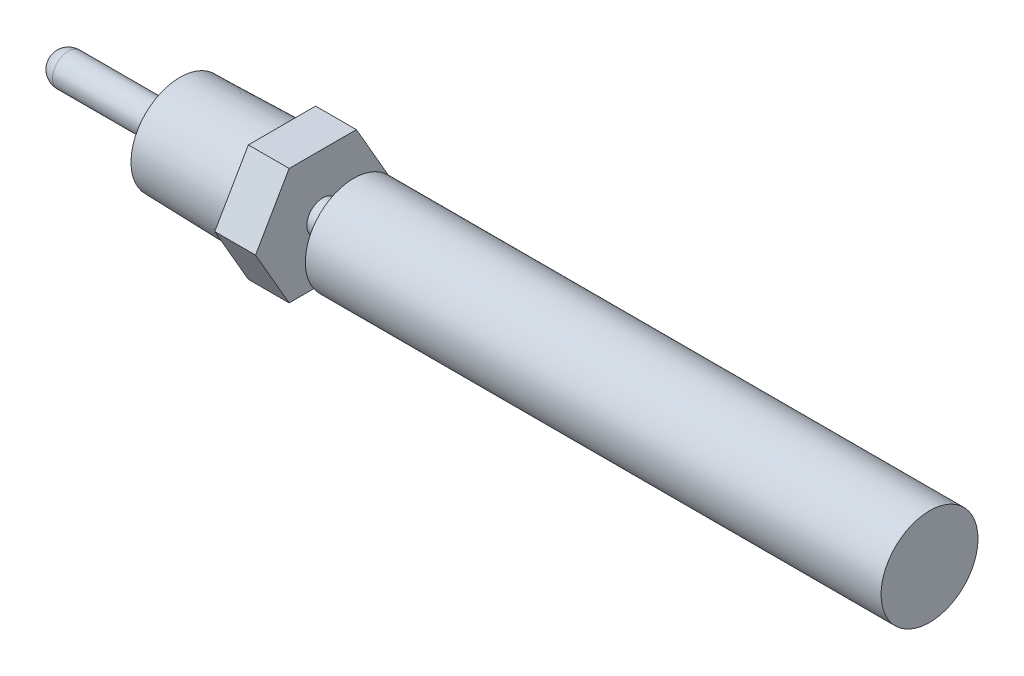
ISO-10303-21;
HEADER;
FILE_DESCRIPTION(('STEP AP214'),'2;1');
FILE_NAME('part.step','',(''),(''),'','','');
FILE_SCHEMA(('AUTOMOTIVE_DESIGN { 1 0 10303 214 1 1 1 1 }'));
ENDSEC;
DATA;
#1=APPLICATION_CONTEXT('core data for automotive mechanical design processes');
#2=APPLICATION_PROTOCOL_DEFINITION('international standard','automotive_design',2000,#1);
#3=PRODUCT_CONTEXT('',#1,'mechanical');
#4=PRODUCT('Part','Part','',(#3));
#5=PRODUCT_RELATED_PRODUCT_CATEGORY('part','',(#4));
#6=PRODUCT_DEFINITION_FORMATION('','',#4);
#7=PRODUCT_DEFINITION_CONTEXT('part definition',#1,'design');
#8=PRODUCT_DEFINITION('design','',#6,#7);
#9=PRODUCT_DEFINITION_SHAPE('','',#8);
#10=(LENGTH_UNIT() NAMED_UNIT(*) SI_UNIT(.MILLI.,.METRE.));
#11=(NAMED_UNIT(*) PLANE_ANGLE_UNIT() SI_UNIT($,.RADIAN.));
#12=(NAMED_UNIT(*) SI_UNIT($,.STERADIAN.) SOLID_ANGLE_UNIT());
#13=UNCERTAINTY_MEASURE_WITH_UNIT(LENGTH_MEASURE(1.E-05),#10,'distance_accuracy_value','');
#14=(GEOMETRIC_REPRESENTATION_CONTEXT(3) GLOBAL_UNCERTAINTY_ASSIGNED_CONTEXT((#13)) GLOBAL_UNIT_ASSIGNED_CONTEXT((#10,
#11,#12)) REPRESENTATION_CONTEXT('',''));
#15=CARTESIAN_POINT('',(0.,0.,0.));
#16=DIRECTION('',(0.,0.,1.));
#17=DIRECTION('',(1.,0.,0.));
#18=AXIS2_PLACEMENT_3D('',#15,#16,#17);
#19=CARTESIAN_POINT('',(25.3365,6.69917482327976,0.));
#20=DIRECTION('',(1.,0.,0.));
#21=DIRECTION('',(0.,0.,-1.));
#22=AXIS2_PLACEMENT_3D('',#19,#20,#21);
#23=PLANE('',#22);
#24=CARTESIAN_POINT('',(25.3365,0.,0.));
#25=DIRECTION('',(1.,0.,0.));
#26=DIRECTION('',(0.,0.,-1.));
#27=AXIS2_PLACEMENT_3D('',#24,#25,#26);
#28=CIRCLE('',#27,1.5875);
#29=CARTESIAN_POINT('',(25.3365,0.,-1.5875));
#30=VERTEX_POINT('',#29);
#31=EDGE_CURVE('E156',#30,#30,#28,.T.);
#32=ORIENTED_EDGE('',*,*,#31,.F.);
#33=EDGE_LOOP('',(#32));
#34=FACE_BOUND('',#33,.T.);
#35=DIRECTION('',(0.,-0.866025403784434,-0.500000000000007));
#36=VECTOR('',#35,1.);
#37=CARTESIAN_POINT('',(25.3365,0.,6.69917482327976));
#38=LINE('',#37,#36);
#39=CARTESIAN_POINT('',(25.3365,0.,6.69917482327976));
#40=VERTEX_POINT('',#39);
#41=CARTESIAN_POINT('',(25.3365,-5.80165558135343,3.34958741163983));
#42=VERTEX_POINT('',#41);
#43=EDGE_CURVE('E131',#40,#42,#38,.T.);
#44=ORIENTED_EDGE('',*,*,#43,.T.);
#45=DIRECTION('',(0.,0.,-1.));
#46=VECTOR('',#45,1.);
#47=CARTESIAN_POINT('',(25.3365,-5.80165558135343,3.34958741163983));
#48=LINE('',#47,#46);
#49=CARTESIAN_POINT('',(25.3365,-5.80165558135336,-3.34958741163995));
#50=VERTEX_POINT('',#49);
#51=EDGE_CURVE('E106',#42,#50,#48,.T.);
#52=ORIENTED_EDGE('',*,*,#51,.T.);
#53=DIRECTION('',(0.,0.866025403784442,-0.499999999999995));
#54=VECTOR('',#53,1.);
#55=CARTESIAN_POINT('',(25.3365,-5.80165558135336,-3.34958741163995));
#56=LINE('',#55,#54);
#57=CARTESIAN_POINT('',(25.3365,0.,-6.69917482327976));
#58=VERTEX_POINT('',#57);
#59=EDGE_CURVE('E354',#50,#58,#56,.T.);
#60=ORIENTED_EDGE('',*,*,#59,.T.);
#61=DIRECTION('',(0.,0.866025403784438,0.500000000000001));
#62=VECTOR('',#61,1.);
#63=CARTESIAN_POINT('',(25.3365,0.,-6.69917482327976));
#64=LINE('',#63,#62);
#65=CARTESIAN_POINT('',(25.3365,5.80165558135341,-3.34958741163987));
#66=VERTEX_POINT('',#65);
#67=EDGE_CURVE('E347',#58,#66,#64,.T.);
#68=ORIENTED_EDGE('',*,*,#67,.T.);
#69=DIRECTION('',(0.,0.,1.));
#70=VECTOR('',#69,1.);
#71=CARTESIAN_POINT('',(25.3365,5.80165558135341,-3.34958741163987));
#72=LINE('',#71,#70);
#73=CARTESIAN_POINT('',(25.3365,5.80165558135338,3.34958741163991));
#74=VERTEX_POINT('',#73);
#75=EDGE_CURVE('E352',#66,#74,#72,.T.);
#76=ORIENTED_EDGE('',*,*,#75,.T.);
#77=DIRECTION('',(0.,-0.866025403784441,0.499999999999995));
#78=VECTOR('',#77,1.);
#79=CARTESIAN_POINT('',(25.3365,5.80165558135338,3.34958741163991));
#80=LINE('',#79,#78);
#81=EDGE_CURVE('E133',#74,#40,#80,.T.);
#82=ORIENTED_EDGE('',*,*,#81,.T.);
#83=EDGE_LOOP('',(#44,#52,#60,#68,#76,#82));
#84=FACE_BOUND('',#83,.T.);
#85=ADVANCED_FACE('F39',(#34,#84),#23,.T.);
#86=CARTESIAN_POINT('',(21.2725,5.14349999999999,0.));
#87=DIRECTION('',(-1.,0.,0.));
#88=DIRECTION('',(0.,0.,1.));
#89=AXIS2_PLACEMENT_3D('',#86,#87,#88);
#90=PLANE('',#89);
#91=CARTESIAN_POINT('',(21.2725,0.,0.));
#92=DIRECTION('',(1.,0.,0.));
#93=DIRECTION('',(0.,0.,-1.));
#94=AXIS2_PLACEMENT_3D('',#91,#92,#93);
#95=CIRCLE('',#94,5.14349999999999);
#96=CARTESIAN_POINT('',(21.2725,0.,-5.14349999999999));
#97=VERTEX_POINT('',#96);
#98=EDGE_CURVE('E152',#97,#97,#95,.T.);
#99=ORIENTED_EDGE('',*,*,#98,.T.);
#100=EDGE_LOOP('',(#99));
#101=FACE_BOUND('',#100,.T.);
#102=DIRECTION('',(0.,0.866025403784442,-0.499999999999995));
#103=VECTOR('',#102,1.);
#104=CARTESIAN_POINT('',(21.2725,-5.80165558135336,-3.34958741163995));
#105=LINE('',#104,#103);
#106=CARTESIAN_POINT('',(21.2725,-5.80165558135336,-3.34958741163995));
#107=VERTEX_POINT('',#106);
#108=CARTESIAN_POINT('',(21.2725,0.,-6.69917482327976));
#109=VERTEX_POINT('',#108);
#110=EDGE_CURVE('E120',#107,#109,#105,.T.);
#111=ORIENTED_EDGE('',*,*,#110,.F.);
#112=DIRECTION('',(0.,0.,-1.));
#113=VECTOR('',#112,1.);
#114=CARTESIAN_POINT('',(21.2725,-5.80165558135343,3.34958741163983));
#115=LINE('',#114,#113);
#116=CARTESIAN_POINT('',(21.2725,-5.80165558135343,3.34958741163983));
#117=VERTEX_POINT('',#116);
#118=EDGE_CURVE('E57',#117,#107,#115,.T.);
#119=ORIENTED_EDGE('',*,*,#118,.F.);
#120=DIRECTION('',(0.,-0.866025403784435,-0.500000000000007));
#121=VECTOR('',#120,1.);
#122=CARTESIAN_POINT('',(21.2725,0.,6.69917482327976));
#123=LINE('',#122,#121);
#124=CARTESIAN_POINT('',(21.2725,0.,6.69917482327976));
#125=VERTEX_POINT('',#124);
#126=EDGE_CURVE('E117',#125,#117,#123,.T.);
#127=ORIENTED_EDGE('',*,*,#126,.F.);
#128=DIRECTION('',(0.,-0.866025403784442,0.499999999999995));
#129=VECTOR('',#128,1.);
#130=CARTESIAN_POINT('',(21.2725,5.80165558135338,3.34958741163991));
#131=LINE('',#130,#129);
#132=CARTESIAN_POINT('',(21.2725,5.80165558135338,3.34958741163991));
#133=VERTEX_POINT('',#132);
#134=EDGE_CURVE('E67',#133,#125,#131,.T.);
#135=ORIENTED_EDGE('',*,*,#134,.F.);
#136=DIRECTION('',(0.,0.,1.));
#137=VECTOR('',#136,1.);
#138=CARTESIAN_POINT('',(21.2725,5.80165558135341,-3.34958741163987));
#139=LINE('',#138,#137);
#140=CARTESIAN_POINT('',(21.2725,5.80165558135341,-3.34958741163987));
#141=VERTEX_POINT('',#140);
#142=EDGE_CURVE('E350',#141,#133,#139,.T.);
#143=ORIENTED_EDGE('',*,*,#142,.F.);
#144=DIRECTION('',(0.,0.866025403784438,0.500000000000001));
#145=VECTOR('',#144,1.);
#146=CARTESIAN_POINT('',(21.2725,0.,-6.69917482327976));
#147=LINE('',#146,#145);
#148=EDGE_CURVE('E122',#109,#141,#147,.T.);
#149=ORIENTED_EDGE('',*,*,#148,.F.);
#150=EDGE_LOOP('',(#111,#119,#127,#135,#143,#149));
#151=FACE_BOUND('',#150,.T.);
#152=ADVANCED_FACE('F116',(#101,#151),#90,.T.);
#153=CARTESIAN_POINT('',(0.,0.,0.));
#154=DIRECTION('',(1.,0.,0.));
#155=DIRECTION('',(0.,1.,0.));
#156=AXIS2_PLACEMENT_3D('',#153,#154,#155);
#157=SPHERICAL_SURFACE('',#156,1.5875);
#158=CARTESIAN_POINT('',(0.,0.,0.));
#159=DIRECTION('',(1.,0.,0.));
#160=DIRECTION('',(0.,0.,-1.));
#161=AXIS2_PLACEMENT_3D('',#158,#159,#160);
#162=CIRCLE('',#161,1.5875);
#163=CARTESIAN_POINT('',(0.,0.,-1.5875));
#164=VERTEX_POINT('',#163);
#165=EDGE_CURVE('E140',#164,#164,#162,.T.);
#166=ORIENTED_EDGE('',*,*,#165,.F.);
#167=EDGE_LOOP('',(#166));
#168=FACE_BOUND('',#167,.T.);
#169=ADVANCED_FACE('F41',(#168),#157,.T.);
#170=CARTESIAN_POINT('',(85.7885,4.826,0.));
#171=DIRECTION('',(1.,0.,0.));
#172=DIRECTION('',(0.,0.,-1.));
#173=AXIS2_PLACEMENT_3D('',#170,#171,#172);
#174=PLANE('',#173);
#175=CARTESIAN_POINT('',(85.7885,0.,0.));
#176=DIRECTION('',(1.,0.,0.));
#177=DIRECTION('',(0.,0.,-1.));
#178=AXIS2_PLACEMENT_3D('',#175,#176,#177);
#179=CIRCLE('',#178,4.826);
#180=CARTESIAN_POINT('',(85.7885,0.,-4.826));
#181=VERTEX_POINT('',#180);
#182=EDGE_CURVE('E11',#181,#181,#179,.T.);
#183=ORIENTED_EDGE('',*,*,#182,.T.);
#184=EDGE_LOOP('',(#183));
#185=FACE_BOUND('',#184,.T.);
#186=ADVANCED_FACE('F183',(#185),#174,.T.);
#187=CARTESIAN_POINT('',(85.7885,0.,0.));
#188=DIRECTION('',(1.,0.,0.));
#189=DIRECTION('',(0.,0.,-1.));
#190=AXIS2_PLACEMENT_3D('',#187,#188,#189);
#191=CYLINDRICAL_SURFACE('',#190,4.826);
#192=CARTESIAN_POINT('',(28.4268556787638,0.,0.));
#193=DIRECTION('',(1.,0.,0.));
#194=DIRECTION('',(0.,0.,-1.));
#195=AXIS2_PLACEMENT_3D('',#192,#193,#194);
#196=CIRCLE('',#195,4.826);
#197=CARTESIAN_POINT('',(28.4268556787638,0.,-4.826));
#198=VERTEX_POINT('',#197);
#199=EDGE_CURVE('E47',#198,#198,#196,.T.);
#200=ORIENTED_EDGE('',*,*,#199,.T.);
#201=EDGE_LOOP('',(#200));
#202=FACE_BOUND('',#201,.T.);
#203=ORIENTED_EDGE('',*,*,#182,.F.);
#204=EDGE_LOOP('',(#203));
#205=FACE_BOUND('',#204,.T.);
#206=ADVANCED_FACE('F168',(#202,#205),#191,.T.);
#207=CARTESIAN_POINT('',(28.4268556787638,1.5875,0.));
#208=DIRECTION('',(-1.,0.,0.));
#209=DIRECTION('',(0.,0.,1.));
#210=AXIS2_PLACEMENT_3D('',#207,#208,#209);
#211=PLANE('',#210);
#212=CARTESIAN_POINT('',(28.4268556787638,0.,0.));
#213=DIRECTION('',(1.,0.,0.));
#214=DIRECTION('',(0.,0.,-1.));
#215=AXIS2_PLACEMENT_3D('',#212,#213,#214);
#216=CIRCLE('',#215,1.5875);
#217=CARTESIAN_POINT('',(28.4268556787638,0.,-1.5875));
#218=VERTEX_POINT('',#217);
#219=EDGE_CURVE('E160',#218,#218,#216,.T.);
#220=ORIENTED_EDGE('',*,*,#219,.T.);
#221=EDGE_LOOP('',(#220));
#222=FACE_BOUND('',#221,.T.);
#223=ORIENTED_EDGE('',*,*,#199,.F.);
#224=EDGE_LOOP('',(#223));
#225=FACE_BOUND('',#224,.T.);
#226=ADVANCED_FACE('F171',(#222,#225),#211,.T.);
#227=CARTESIAN_POINT('',(85.7885,0.,0.));
#228=DIRECTION('',(1.,0.,0.));
#229=DIRECTION('',(0.,0.,-1.));
#230=AXIS2_PLACEMENT_3D('',#227,#228,#229);
#231=CYLINDRICAL_SURFACE('',#230,1.5875);
#232=ORIENTED_EDGE('',*,*,#31,.T.);
#233=EDGE_LOOP('',(#232));
#234=FACE_BOUND('',#233,.T.);
#235=ORIENTED_EDGE('',*,*,#219,.F.);
#236=EDGE_LOOP('',(#235));
#237=FACE_BOUND('',#236,.T.);
#238=ADVANCED_FACE('F173',(#234,#237),#231,.T.);
#239=CARTESIAN_POINT('',(21.2725,0.,0.));
#240=DIRECTION('',(1.,0.,0.));
#241=DIRECTION('',(0.,0.,-1.));
#242=AXIS2_PLACEMENT_3D('',#239,#240,#241);
#243=CONICAL_SURFACE('',#242,5.14349999999999,0.0256563400043171);
#244=CARTESIAN_POINT('',(11.1125,0.,0.));
#245=DIRECTION('',(1.,0.,0.));
#246=DIRECTION('',(0.,0.,-1.));
#247=AXIS2_PLACEMENT_3D('',#244,#245,#246);
#248=CIRCLE('',#247,4.88277437569086);
#249=CARTESIAN_POINT('',(11.1125,0.,-4.88277437569086));
#250=VERTEX_POINT('',#249);
#251=EDGE_CURVE('E148',#250,#250,#248,.T.);
#252=ORIENTED_EDGE('',*,*,#251,.T.);
#253=EDGE_LOOP('',(#252));
#254=FACE_BOUND('',#253,.T.);
#255=ORIENTED_EDGE('',*,*,#98,.F.);
#256=EDGE_LOOP('',(#255));
#257=FACE_BOUND('',#256,.T.);
#258=ADVANCED_FACE('F180',(#254,#257),#243,.T.);
#259=CARTESIAN_POINT('',(11.1125,1.5875,0.));
#260=DIRECTION('',(-1.,0.,0.));
#261=DIRECTION('',(0.,0.,1.));
#262=AXIS2_PLACEMENT_3D('',#259,#260,#261);
#263=PLANE('',#262);
#264=CARTESIAN_POINT('',(11.1125,0.,0.));
#265=DIRECTION('',(1.,0.,0.));
#266=DIRECTION('',(0.,0.,-1.));
#267=AXIS2_PLACEMENT_3D('',#264,#265,#266);
#268=CIRCLE('',#267,1.5875);
#269=CARTESIAN_POINT('',(11.1125,0.,-1.5875));
#270=VERTEX_POINT('',#269);
#271=EDGE_CURVE('E144',#270,#270,#268,.T.);
#272=ORIENTED_EDGE('',*,*,#271,.T.);
#273=EDGE_LOOP('',(#272));
#274=FACE_BOUND('',#273,.T.);
#275=ORIENTED_EDGE('',*,*,#251,.F.);
#276=EDGE_LOOP('',(#275));
#277=FACE_BOUND('',#276,.T.);
#278=ADVANCED_FACE('F198',(#274,#277),#263,.T.);
#279=CARTESIAN_POINT('',(85.7885,0.,0.));
#280=DIRECTION('',(1.,0.,0.));
#281=DIRECTION('',(0.,0.,-1.));
#282=AXIS2_PLACEMENT_3D('',#279,#280,#281);
#283=CYLINDRICAL_SURFACE('',#282,1.5875);
#284=ORIENTED_EDGE('',*,*,#165,.T.);
#285=EDGE_LOOP('',(#284));
#286=FACE_BOUND('',#285,.T.);
#287=ORIENTED_EDGE('',*,*,#271,.F.);
#288=EDGE_LOOP('',(#287));
#289=FACE_BOUND('',#288,.T.);
#290=ADVANCED_FACE('F202',(#286,#289),#283,.T.);
#291=CARTESIAN_POINT('',(-1.5885,0.,6.69917482327976));
#292=DIRECTION('',(0.,-0.500000000000007,0.866025403784435));
#293=DIRECTION('',(0.,-0.866025403784435,-0.500000000000007));
#294=AXIS2_PLACEMENT_3D('',#291,#292,#293);
#295=PLANE('',#294);
#296=ORIENTED_EDGE('',*,*,#126,.T.);
#297=DIRECTION('',(1.,0.,0.));
#298=VECTOR('',#297,1.);
#299=CARTESIAN_POINT('',(85.7885,-5.80165558135343,3.34958741163983));
#300=LINE('',#299,#298);
#301=EDGE_CURVE('E103',#117,#42,#300,.T.);
#302=ORIENTED_EDGE('',*,*,#301,.T.);
#303=ORIENTED_EDGE('',*,*,#43,.F.);
#304=DIRECTION('',(1.,0.,0.));
#305=VECTOR('',#304,1.);
#306=CARTESIAN_POINT('',(85.7885,0.,6.69917482327976));
#307=LINE('',#306,#305);
#308=EDGE_CURVE('E126',#125,#40,#307,.T.);
#309=ORIENTED_EDGE('',*,*,#308,.F.);
#310=EDGE_LOOP('',(#296,#302,#303,#309));
#311=FACE_BOUND('',#310,.T.);
#312=ADVANCED_FACE('F125',(#311),#295,.T.);
#313=CARTESIAN_POINT('',(-1.5885,5.80165558135338,3.34958741163991));
#314=DIRECTION('',(0.,0.499999999999995,0.866025403784442));
#315=DIRECTION('',(0.,-0.866025403784442,0.499999999999995));
#316=AXIS2_PLACEMENT_3D('',#313,#314,#315);
#317=PLANE('',#316);
#318=ORIENTED_EDGE('',*,*,#134,.T.);
#319=ORIENTED_EDGE('',*,*,#308,.T.);
#320=ORIENTED_EDGE('',*,*,#81,.F.);
#321=DIRECTION('',(1.,0.,0.));
#322=VECTOR('',#321,1.);
#323=CARTESIAN_POINT('',(85.7885,5.80165558135338,3.34958741163991));
#324=LINE('',#323,#322);
#325=EDGE_CURVE('E357',#133,#74,#324,.T.);
#326=ORIENTED_EDGE('',*,*,#325,.F.);
#327=EDGE_LOOP('',(#318,#319,#320,#326));
#328=FACE_BOUND('',#327,.T.);
#329=ADVANCED_FACE('F209',(#328),#317,.T.);
#330=CARTESIAN_POINT('',(-1.5885,5.80165558135341,-3.34958741163987));
#331=DIRECTION('',(0.,1.,0.));
#332=DIRECTION('',(0.,0.,1.));
#333=AXIS2_PLACEMENT_3D('',#330,#331,#332);
#334=PLANE('',#333);
#335=ORIENTED_EDGE('',*,*,#142,.T.);
#336=ORIENTED_EDGE('',*,*,#325,.T.);
#337=ORIENTED_EDGE('',*,*,#75,.F.);
#338=DIRECTION('',(1.,0.,0.));
#339=VECTOR('',#338,1.);
#340=CARTESIAN_POINT('',(-1.5885,5.80165558135341,-3.34958741163987));
#341=LINE('',#340,#339);
#342=EDGE_CURVE('E341',#141,#66,#341,.T.);
#343=ORIENTED_EDGE('',*,*,#342,.F.);
#344=EDGE_LOOP('',(#335,#336,#337,#343));
#345=FACE_BOUND('',#344,.T.);
#346=ADVANCED_FACE('F212',(#345),#334,.T.);
#347=CARTESIAN_POINT('',(-1.5885,-5.80165558135336,-3.34958741163995));
#348=DIRECTION('',(0.,-0.499999999999995,-0.866025403784441));
#349=DIRECTION('',(0.,0.866025403784442,-0.499999999999995));
#350=AXIS2_PLACEMENT_3D('',#347,#348,#349);
#351=PLANE('',#350);
#352=ORIENTED_EDGE('',*,*,#110,.T.);
#353=DIRECTION('',(1.,0.,0.));
#354=VECTOR('',#353,1.);
#355=CARTESIAN_POINT('',(-1.5885,0.,-6.69917482327976));
#356=LINE('',#355,#354);
#357=EDGE_CURVE('E344',#109,#58,#356,.T.);
#358=ORIENTED_EDGE('',*,*,#357,.T.);
#359=ORIENTED_EDGE('',*,*,#59,.F.);
#360=DIRECTION('',(1.,0.,0.));
#361=VECTOR('',#360,1.);
#362=CARTESIAN_POINT('',(85.7885,-5.80165558135336,-3.34958741163995));
#363=LINE('',#362,#361);
#364=EDGE_CURVE('E123',#107,#50,#363,.T.);
#365=ORIENTED_EDGE('',*,*,#364,.F.);
#366=EDGE_LOOP('',(#352,#358,#359,#365));
#367=FACE_BOUND('',#366,.T.);
#368=ADVANCED_FACE('F215',(#367),#351,.T.);
#369=CARTESIAN_POINT('',(-1.5885,0.,-6.69917482327976));
#370=DIRECTION('',(0.,0.500000000000001,-0.866025403784438));
#371=DIRECTION('',(0.,0.866025403784438,0.500000000000001));
#372=AXIS2_PLACEMENT_3D('',#369,#370,#371);
#373=PLANE('',#372);
#374=ORIENTED_EDGE('',*,*,#148,.T.);
#375=ORIENTED_EDGE('',*,*,#342,.T.);
#376=ORIENTED_EDGE('',*,*,#67,.F.);
#377=ORIENTED_EDGE('',*,*,#357,.F.);
#378=EDGE_LOOP('',(#374,#375,#376,#377));
#379=FACE_BOUND('',#378,.T.);
#380=ADVANCED_FACE('F219',(#379),#373,.T.);
#381=CARTESIAN_POINT('',(-1.5885,-5.80165558135343,3.34958741163983));
#382=DIRECTION('',(0.,-1.,0.));
#383=DIRECTION('',(0.,0.,-1.));
#384=AXIS2_PLACEMENT_3D('',#381,#382,#383);
#385=PLANE('',#384);
#386=ORIENTED_EDGE('',*,*,#118,.T.);
#387=ORIENTED_EDGE('',*,*,#364,.T.);
#388=ORIENTED_EDGE('',*,*,#51,.F.);
#389=ORIENTED_EDGE('',*,*,#301,.F.);
#390=EDGE_LOOP('',(#386,#387,#388,#389));
#391=FACE_BOUND('',#390,.T.);
#392=ADVANCED_FACE('F104',(#391),#385,.T.);
#393=CLOSED_SHELL('',(#85,#152,#169,#186,#206,#226,#238,#258,#278,#290,#312,#329,#346,#368,#380,#392));
#394=MANIFOLD_SOLID_BREP('B2',#393);
#395=ADVANCED_BREP_SHAPE_REPRESENTATION('',(#18,#394),#14);
#396=SHAPE_DEFINITION_REPRESENTATION(#9,#395);
ENDSEC;
END-ISO-10303-21;
